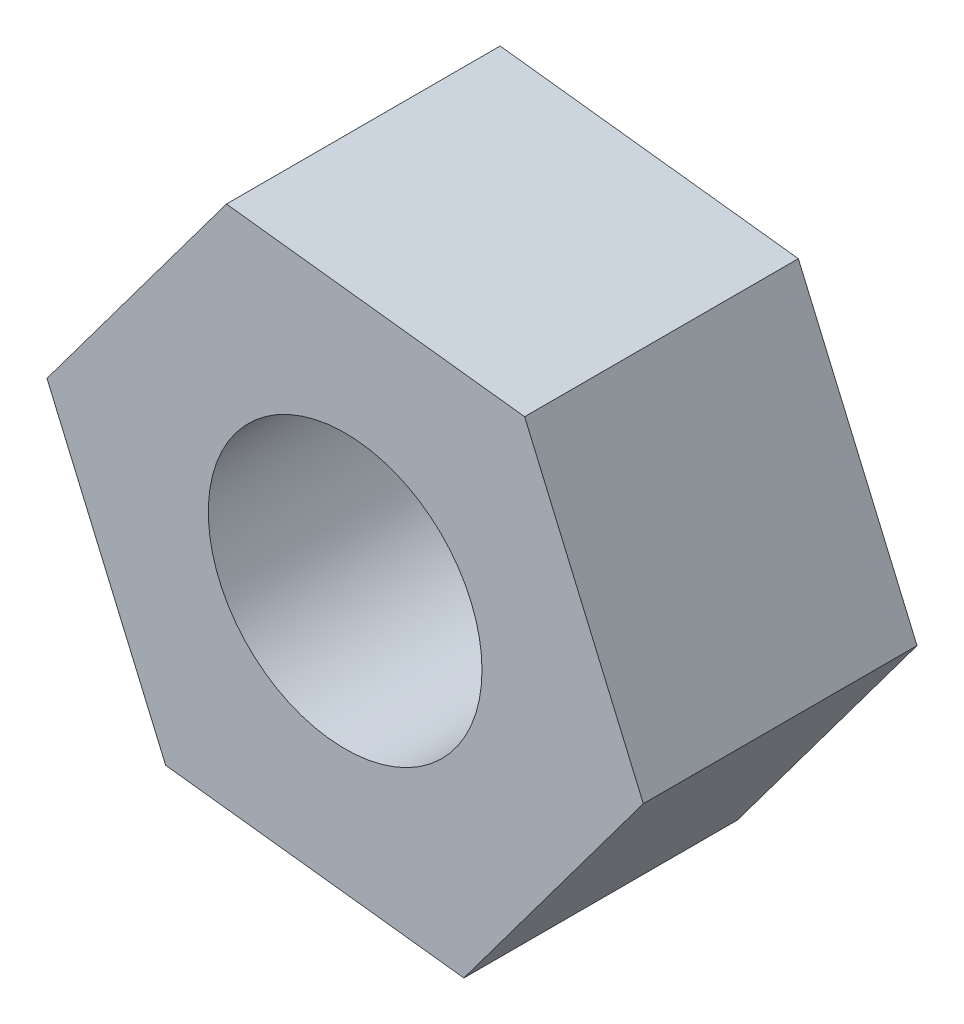
ISO-10303-21;
HEADER;
FILE_DESCRIPTION(('STEP AP214'),'2;1');
FILE_NAME('part.step','',(''),(''),'','','');
FILE_SCHEMA(('AUTOMOTIVE_DESIGN { 1 0 10303 214 1 1 1 1 }'));
ENDSEC;
DATA;
#1=APPLICATION_CONTEXT('core data for automotive mechanical design processes');
#2=APPLICATION_PROTOCOL_DEFINITION('international standard','automotive_design',2000,#1);
#3=PRODUCT_CONTEXT('',#1,'mechanical');
#4=PRODUCT('Part','Part','',(#3));
#5=PRODUCT_RELATED_PRODUCT_CATEGORY('part','',(#4));
#6=PRODUCT_DEFINITION_FORMATION('','',#4);
#7=PRODUCT_DEFINITION_CONTEXT('part definition',#1,'design');
#8=PRODUCT_DEFINITION('design','',#6,#7);
#9=PRODUCT_DEFINITION_SHAPE('','',#8);
#10=(LENGTH_UNIT() NAMED_UNIT(*) SI_UNIT(.MILLI.,.METRE.));
#11=(NAMED_UNIT(*) PLANE_ANGLE_UNIT() SI_UNIT($,.RADIAN.));
#12=(NAMED_UNIT(*) SI_UNIT($,.STERADIAN.) SOLID_ANGLE_UNIT());
#13=UNCERTAINTY_MEASURE_WITH_UNIT(LENGTH_MEASURE(1.E-05),#10,'distance_accuracy_value','');
#14=(GEOMETRIC_REPRESENTATION_CONTEXT(3) GLOBAL_UNCERTAINTY_ASSIGNED_CONTEXT((#13)) GLOBAL_UNIT_ASSIGNED_CONTEXT((#10,
#11,#12)) REPRESENTATION_CONTEXT('',''));
#15=CARTESIAN_POINT('',(0.,0.,0.));
#16=DIRECTION('',(0.,0.,1.));
#17=DIRECTION('',(1.,0.,0.));
#18=AXIS2_PLACEMENT_3D('',#15,#16,#17);
#19=CARTESIAN_POINT('',(0.,0.,2.));
#20=DIRECTION('',(0.,0.,1.));
#21=DIRECTION('',(1.,0.,0.));
#22=AXIS2_PLACEMENT_3D('',#19,#20,#21);
#23=PLANE('',#22);
#24=DIRECTION('',(-0.395394448147516,0.918511420927427,0.));
#25=VECTOR('',#24,1.);
#26=CARTESIAN_POINT('',(-17.9512238235559,-20.7478683754745,2.));
#27=LINE('',#26,#25);
#28=CARTESIAN_POINT('',(-17.9512238235559,-20.7478683754745,2.));
#29=VERTEX_POINT('',#28);
#30=CARTESIAN_POINT('',(-18.8186919696373,-18.732717674195,2.));
#31=VERTEX_POINT('',#30);
#32=EDGE_CURVE('E135',#29,#31,#27,.T.);
#33=ORIENTED_EDGE('',*,*,#32,.T.);
#34=DIRECTION('',(-0.993151448263052,0.116834073852636,0.));
#35=VECTOR('',#34,1.);
#36=CARTESIAN_POINT('',(-18.8186919696373,-18.732717674195,2.));
#37=LINE('',#36,#35);
#38=CARTESIAN_POINT('',(-20.9975977424401,-18.4763917750355,2.));
#39=VERTEX_POINT('',#38);
#40=EDGE_CURVE('E93',#31,#39,#37,.T.);
#41=ORIENTED_EDGE('',*,*,#40,.T.);
#42=DIRECTION('',(-0.597757000115537,-0.80167734707479,0.));
#43=VECTOR('',#42,1.);
#44=CARTESIAN_POINT('',(-20.9975977424401,-18.4763917750355,2.));
#45=LINE('',#44,#43);
#46=CARTESIAN_POINT('',(-22.3090353691615,-20.2352165771555,2.));
#47=VERTEX_POINT('',#46);
#48=EDGE_CURVE('E106',#39,#47,#45,.T.);
#49=ORIENTED_EDGE('',*,*,#48,.T.);
#50=DIRECTION('',(0.395394448147512,-0.918511420927429,0.));
#51=VECTOR('',#50,1.);
#52=CARTESIAN_POINT('',(-22.3090353691615,-20.2352165771555,2.));
#53=LINE('',#52,#51);
#54=CARTESIAN_POINT('',(-21.4415672230801,-22.2503672784351,2.));
#55=VERTEX_POINT('',#54);
#56=EDGE_CURVE('E100',#47,#55,#53,.T.);
#57=ORIENTED_EDGE('',*,*,#56,.T.);
#58=DIRECTION('',(0.993151448263051,-0.116834073852639,0.));
#59=VECTOR('',#58,1.);
#60=CARTESIAN_POINT('',(-21.4415672230801,-22.2503672784351,2.));
#61=LINE('',#60,#59);
#62=CARTESIAN_POINT('',(-19.2626614502773,-22.5066931775946,2.));
#63=VERTEX_POINT('',#62);
#64=EDGE_CURVE('E104',#55,#63,#61,.T.);
#65=ORIENTED_EDGE('',*,*,#64,.T.);
#66=DIRECTION('',(0.597757000115536,0.801677347074791,0.));
#67=VECTOR('',#66,1.);
#68=CARTESIAN_POINT('',(-19.2626614502773,-22.5066931775946,2.));
#69=LINE('',#68,#67);
#70=EDGE_CURVE('E56',#63,#29,#69,.T.);
#71=ORIENTED_EDGE('',*,*,#70,.T.);
#72=EDGE_LOOP('',(#33,#41,#49,#57,#65,#71));
#73=FACE_BOUND('',#72,.T.);
#74=CARTESIAN_POINT('',(-20.1301295963587,-20.491542476315,2.));
#75=DIRECTION('',(0.,0.,1.));
#76=DIRECTION('',(1.,0.,0.));
#77=AXIS2_PLACEMENT_3D('',#74,#75,#76);
#78=CIRCLE('',#77,1.);
#79=CARTESIAN_POINT('',(-19.1301295963587,-20.491542476315,2.));
#80=VERTEX_POINT('',#79);
#81=EDGE_CURVE('E128',#80,#80,#78,.T.);
#82=ORIENTED_EDGE('',*,*,#81,.F.);
#83=EDGE_LOOP('',(#82));
#84=FACE_BOUND('',#83,.T.);
#85=ADVANCED_FACE('F39',(#73,#84),#23,.T.);
#86=CARTESIAN_POINT('',(0.,0.,0.));
#87=DIRECTION('',(0.,0.,1.));
#88=DIRECTION('',(1.,0.,0.));
#89=AXIS2_PLACEMENT_3D('',#86,#87,#88);
#90=PLANE('',#89);
#91=DIRECTION('',(-0.395394448147516,0.918511420927427,0.));
#92=VECTOR('',#91,1.);
#93=CARTESIAN_POINT('',(-17.9512238235559,-20.7478683754745,0.));
#94=LINE('',#93,#92);
#95=CARTESIAN_POINT('',(-17.9512238235559,-20.7478683754745,0.));
#96=VERTEX_POINT('',#95);
#97=CARTESIAN_POINT('',(-18.8186919696373,-18.732717674195,0.));
#98=VERTEX_POINT('',#97);
#99=EDGE_CURVE('E124',#96,#98,#94,.T.);
#100=ORIENTED_EDGE('',*,*,#99,.F.);
#101=DIRECTION('',(0.597757000115536,0.801677347074791,0.));
#102=VECTOR('',#101,1.);
#103=CARTESIAN_POINT('',(-19.2626614502773,-22.5066931775946,0.));
#104=LINE('',#103,#102);
#105=CARTESIAN_POINT('',(-19.2626614502773,-22.5066931775946,0.));
#106=VERTEX_POINT('',#105);
#107=EDGE_CURVE('E85',#106,#96,#104,.T.);
#108=ORIENTED_EDGE('',*,*,#107,.F.);
#109=DIRECTION('',(0.993151448263051,-0.116834073852639,0.));
#110=VECTOR('',#109,1.);
#111=CARTESIAN_POINT('',(-21.4415672230801,-22.2503672784351,0.));
#112=LINE('',#111,#110);
#113=CARTESIAN_POINT('',(-21.4415672230801,-22.2503672784351,0.));
#114=VERTEX_POINT('',#113);
#115=EDGE_CURVE('E79',#114,#106,#112,.T.);
#116=ORIENTED_EDGE('',*,*,#115,.F.);
#117=DIRECTION('',(0.395394448147512,-0.918511420927429,0.));
#118=VECTOR('',#117,1.);
#119=CARTESIAN_POINT('',(-22.3090353691615,-20.2352165771555,0.));
#120=LINE('',#119,#118);
#121=CARTESIAN_POINT('',(-22.3090353691615,-20.2352165771555,0.));
#122=VERTEX_POINT('',#121);
#123=EDGE_CURVE('E114',#122,#114,#120,.T.);
#124=ORIENTED_EDGE('',*,*,#123,.F.);
#125=DIRECTION('',(-0.597757000115537,-0.80167734707479,0.));
#126=VECTOR('',#125,1.);
#127=CARTESIAN_POINT('',(-20.9975977424401,-18.4763917750355,0.));
#128=LINE('',#127,#126);
#129=CARTESIAN_POINT('',(-20.9975977424401,-18.4763917750355,0.));
#130=VERTEX_POINT('',#129);
#131=EDGE_CURVE('E130',#130,#122,#128,.T.);
#132=ORIENTED_EDGE('',*,*,#131,.F.);
#133=DIRECTION('',(-0.993151448263052,0.116834073852636,0.));
#134=VECTOR('',#133,1.);
#135=CARTESIAN_POINT('',(-18.8186919696373,-18.732717674195,0.));
#136=LINE('',#135,#134);
#137=EDGE_CURVE('E127',#98,#130,#136,.T.);
#138=ORIENTED_EDGE('',*,*,#137,.F.);
#139=EDGE_LOOP('',(#100,#108,#116,#124,#132,#138));
#140=FACE_BOUND('',#139,.T.);
#141=CARTESIAN_POINT('',(-20.1301295963587,-20.491542476315,0.));
#142=DIRECTION('',(0.,0.,1.));
#143=DIRECTION('',(1.,0.,0.));
#144=AXIS2_PLACEMENT_3D('',#141,#142,#143);
#145=CIRCLE('',#144,1.);
#146=CARTESIAN_POINT('',(-19.1301295963587,-20.491542476315,0.));
#147=VERTEX_POINT('',#146);
#148=EDGE_CURVE('E246',#147,#147,#145,.T.);
#149=ORIENTED_EDGE('',*,*,#148,.T.);
#150=EDGE_LOOP('',(#149));
#151=FACE_BOUND('',#150,.T.);
#152=ADVANCED_FACE('F144',(#140,#151),#90,.F.);
#153=CARTESIAN_POINT('',(-17.9512238235559,-20.7478683754745,2.));
#154=DIRECTION('',(-0.918511420927427,-0.395394448147516,0.));
#155=DIRECTION('',(0.395394448147516,-0.918511420927427,0.));
#156=AXIS2_PLACEMENT_3D('',#153,#154,#155);
#157=PLANE('',#156);
#158=ORIENTED_EDGE('',*,*,#99,.T.);
#159=DIRECTION('',(0.,0.,-1.));
#160=VECTOR('',#159,1.);
#161=CARTESIAN_POINT('',(-18.8186919696373,-18.732717674195,2.));
#162=LINE('',#161,#160);
#163=EDGE_CURVE('E11',#31,#98,#162,.T.);
#164=ORIENTED_EDGE('',*,*,#163,.F.);
#165=ORIENTED_EDGE('',*,*,#32,.F.);
#166=DIRECTION('',(0.,0.,-1.));
#167=VECTOR('',#166,1.);
#168=CARTESIAN_POINT('',(-17.9512238235559,-20.7478683754745,2.));
#169=LINE('',#168,#167);
#170=EDGE_CURVE('E120',#29,#96,#169,.T.);
#171=ORIENTED_EDGE('',*,*,#170,.T.);
#172=EDGE_LOOP('',(#158,#164,#165,#171));
#173=FACE_BOUND('',#172,.T.);
#174=ADVANCED_FACE('F41',(#173),#157,.F.);
#175=CARTESIAN_POINT('',(-18.8186919696373,-18.732717674195,2.));
#176=DIRECTION('',(-0.116834073852636,-0.993151448263052,0.));
#177=DIRECTION('',(0.993151448263052,-0.116834073852636,0.));
#178=AXIS2_PLACEMENT_3D('',#175,#176,#177);
#179=PLANE('',#178);
#180=ORIENTED_EDGE('',*,*,#137,.T.);
#181=DIRECTION('',(0.,0.,-1.));
#182=VECTOR('',#181,1.);
#183=CARTESIAN_POINT('',(-20.9975977424401,-18.4763917750355,2.));
#184=LINE('',#183,#182);
#185=EDGE_CURVE('E48',#39,#130,#184,.T.);
#186=ORIENTED_EDGE('',*,*,#185,.F.);
#187=ORIENTED_EDGE('',*,*,#40,.F.);
#188=ORIENTED_EDGE('',*,*,#163,.T.);
#189=EDGE_LOOP('',(#180,#186,#187,#188));
#190=FACE_BOUND('',#189,.T.);
#191=ADVANCED_FACE('F169',(#190),#179,.F.);
#192=CARTESIAN_POINT('',(-20.9975977424401,-18.4763917750355,2.));
#193=DIRECTION('',(0.80167734707479,-0.597757000115537,0.));
#194=DIRECTION('',(0.597757000115537,0.80167734707479,0.));
#195=AXIS2_PLACEMENT_3D('',#192,#193,#194);
#196=PLANE('',#195);
#197=ORIENTED_EDGE('',*,*,#131,.T.);
#198=DIRECTION('',(0.,0.,-1.));
#199=VECTOR('',#198,1.);
#200=CARTESIAN_POINT('',(-22.3090353691615,-20.2352165771555,2.));
#201=LINE('',#200,#199);
#202=EDGE_CURVE('E115',#47,#122,#201,.T.);
#203=ORIENTED_EDGE('',*,*,#202,.F.);
#204=ORIENTED_EDGE('',*,*,#48,.F.);
#205=ORIENTED_EDGE('',*,*,#185,.T.);
#206=EDGE_LOOP('',(#197,#203,#204,#205));
#207=FACE_BOUND('',#206,.T.);
#208=ADVANCED_FACE('F141',(#207),#196,.F.);
#209=CARTESIAN_POINT('',(-22.3090353691615,-20.2352165771555,2.));
#210=DIRECTION('',(0.918511420927429,0.395394448147512,0.));
#211=DIRECTION('',(-0.395394448147512,0.918511420927429,0.));
#212=AXIS2_PLACEMENT_3D('',#209,#210,#211);
#213=PLANE('',#212);
#214=ORIENTED_EDGE('',*,*,#123,.T.);
#215=DIRECTION('',(0.,0.,-1.));
#216=VECTOR('',#215,1.);
#217=CARTESIAN_POINT('',(-21.4415672230801,-22.2503672784351,2.));
#218=LINE('',#217,#216);
#219=EDGE_CURVE('E111',#55,#114,#218,.T.);
#220=ORIENTED_EDGE('',*,*,#219,.F.);
#221=ORIENTED_EDGE('',*,*,#56,.F.);
#222=ORIENTED_EDGE('',*,*,#202,.T.);
#223=EDGE_LOOP('',(#214,#220,#221,#222));
#224=FACE_BOUND('',#223,.T.);
#225=ADVANCED_FACE('F112',(#224),#213,.F.);
#226=CARTESIAN_POINT('',(-21.4415672230801,-22.2503672784351,2.));
#227=DIRECTION('',(0.116834073852639,0.993151448263051,0.));
#228=DIRECTION('',(-0.993151448263051,0.116834073852639,0.));
#229=AXIS2_PLACEMENT_3D('',#226,#227,#228);
#230=PLANE('',#229);
#231=ORIENTED_EDGE('',*,*,#115,.T.);
#232=DIRECTION('',(0.,0.,-1.));
#233=VECTOR('',#232,1.);
#234=CARTESIAN_POINT('',(-19.2626614502773,-22.5066931775946,2.));
#235=LINE('',#234,#233);
#236=EDGE_CURVE('E116',#63,#106,#235,.T.);
#237=ORIENTED_EDGE('',*,*,#236,.F.);
#238=ORIENTED_EDGE('',*,*,#64,.F.);
#239=ORIENTED_EDGE('',*,*,#219,.T.);
#240=EDGE_LOOP('',(#231,#237,#238,#239));
#241=FACE_BOUND('',#240,.T.);
#242=ADVANCED_FACE('F118',(#241),#230,.F.);
#243=CARTESIAN_POINT('',(-19.2626614502773,-22.5066931775946,2.));
#244=DIRECTION('',(-0.801677347074792,0.597757000115536,0.));
#245=DIRECTION('',(-0.597757000115536,-0.801677347074791,0.));
#246=AXIS2_PLACEMENT_3D('',#243,#244,#245);
#247=PLANE('',#246);
#248=ORIENTED_EDGE('',*,*,#107,.T.);
#249=ORIENTED_EDGE('',*,*,#170,.F.);
#250=ORIENTED_EDGE('',*,*,#70,.F.);
#251=ORIENTED_EDGE('',*,*,#236,.T.);
#252=EDGE_LOOP('',(#248,#249,#250,#251));
#253=FACE_BOUND('',#252,.T.);
#254=ADVANCED_FACE('F149',(#253),#247,.F.);
#255=CARTESIAN_POINT('',(-20.1301295963587,-20.491542476315,2.));
#256=DIRECTION('',(0.,0.,-1.));
#257=DIRECTION('',(-1.,0.,0.));
#258=AXIS2_PLACEMENT_3D('',#255,#256,#257);
#259=CYLINDRICAL_SURFACE('',#258,1.);
#260=ORIENTED_EDGE('',*,*,#81,.T.);
#261=EDGE_LOOP('',(#260));
#262=FACE_BOUND('',#261,.T.);
#263=ORIENTED_EDGE('',*,*,#148,.F.);
#264=EDGE_LOOP('',(#263));
#265=FACE_BOUND('',#264,.T.);
#266=ADVANCED_FACE('F151',(#262,#265),#259,.F.);
#267=CLOSED_SHELL('',(#85,#152,#174,#191,#208,#225,#242,#254,#266));
#268=MANIFOLD_SOLID_BREP('B2',#267);
#269=ADVANCED_BREP_SHAPE_REPRESENTATION('',(#18,#268),#14);
#270=SHAPE_DEFINITION_REPRESENTATION(#9,#269);
ENDSEC;
END-ISO-10303-21;
